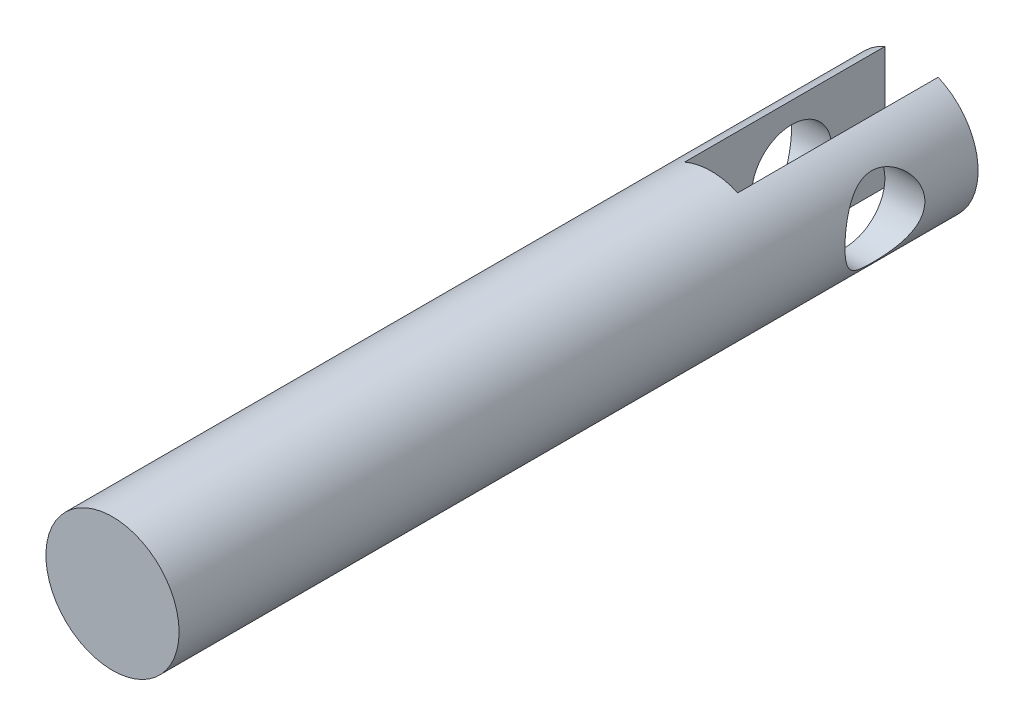
ISO-10303-21;
HEADER;
FILE_DESCRIPTION(('STEP AP214'),'2;1');
FILE_NAME('part.step','',(''),(''),'','','');
FILE_SCHEMA(('AUTOMOTIVE_DESIGN { 1 0 10303 214 1 1 1 1 }'));
ENDSEC;
DATA;
#1=APPLICATION_CONTEXT('core data for automotive mechanical design processes');
#2=APPLICATION_PROTOCOL_DEFINITION('international standard','automotive_design',2000,#1);
#3=PRODUCT_CONTEXT('',#1,'mechanical');
#4=PRODUCT('Part','Part','',(#3));
#5=PRODUCT_RELATED_PRODUCT_CATEGORY('part','',(#4));
#6=PRODUCT_DEFINITION_FORMATION('','',#4);
#7=PRODUCT_DEFINITION_CONTEXT('part definition',#1,'design');
#8=PRODUCT_DEFINITION('design','',#6,#7);
#9=PRODUCT_DEFINITION_SHAPE('','',#8);
#10=(LENGTH_UNIT() NAMED_UNIT(*) SI_UNIT(.MILLI.,.METRE.));
#11=(NAMED_UNIT(*) PLANE_ANGLE_UNIT() SI_UNIT($,.RADIAN.));
#12=(NAMED_UNIT(*) SI_UNIT($,.STERADIAN.) SOLID_ANGLE_UNIT());
#13=UNCERTAINTY_MEASURE_WITH_UNIT(LENGTH_MEASURE(1.E-05),#10,'distance_accuracy_value','');
#14=(GEOMETRIC_REPRESENTATION_CONTEXT(3) GLOBAL_UNCERTAINTY_ASSIGNED_CONTEXT((#13)) GLOBAL_UNIT_ASSIGNED_CONTEXT((#10,
#11,#12)) REPRESENTATION_CONTEXT('',''));
#15=CARTESIAN_POINT('',(0.,0.,0.));
#16=DIRECTION('',(0.,0.,1.));
#17=DIRECTION('',(1.,0.,0.));
#18=AXIS2_PLACEMENT_3D('',#15,#16,#17);
#19=CARTESIAN_POINT('',(0.,0.,0.));
#20=DIRECTION('',(0.,0.,1.));
#21=DIRECTION('',(1.,0.,0.));
#22=AXIS2_PLACEMENT_3D('',#19,#20,#21);
#23=PLANE('',#22);
#24=DIRECTION('',(0.,1.,0.));
#25=VECTOR('',#24,1.);
#26=CARTESIAN_POINT('',(-4.,0.,0.));
#27=LINE('',#26,#25);
#28=CARTESIAN_POINT('',(-4.,-9.16515138991168,0.));
#29=VERTEX_POINT('',#28);
#30=CARTESIAN_POINT('',(-4.,9.16515138991168,0.));
#31=VERTEX_POINT('',#30);
#32=EDGE_CURVE('E84',#29,#31,#27,.T.);
#33=ORIENTED_EDGE('',*,*,#32,.F.);
#34=CARTESIAN_POINT('',(0.,0.,0.));
#35=DIRECTION('',(0.,0.,1.));
#36=DIRECTION('',(1.,0.,0.));
#37=AXIS2_PLACEMENT_3D('',#34,#35,#36);
#38=CIRCLE('',#37,10.);
#39=EDGE_CURVE('E100',#31,#29,#38,.T.);
#40=ORIENTED_EDGE('',*,*,#39,.F.);
#41=EDGE_LOOP('',(#33,#40));
#42=FACE_BOUND('',#41,.T.);
#43=ADVANCED_FACE('F39',(#42),#23,.F.);
#44=CARTESIAN_POINT('',(40.,0.,14.));
#45=DIRECTION('',(-1.,0.,0.));
#46=DIRECTION('',(0.,0.,1.));
#47=AXIS2_PLACEMENT_3D('',#44,#45,#46);
#48=CYLINDRICAL_SURFACE('',#47,6.);
#49=CARTESIAN_POINT('',(-10.,0.,20.));
#50=CARTESIAN_POINT('',(-9.99999883168644,0.153537444551437,19.9999987451914));
#51=CARTESIAN_POINT('',(-9.99645496091162,0.307113729394929,19.9940973573995));
#52=CARTESIAN_POINT('',(-9.98236364463673,0.613107521326879,19.9705669868412));
#53=CARTESIAN_POINT('',(-9.97181210130936,0.765524297600021,19.9529311421879));
#54=CARTESIAN_POINT('',(-9.94394249918953,1.06824745150987,19.9061278956508));
#55=CARTESIAN_POINT('',(-9.926611630499,1.21854927251923,19.8769386617741));
#56=CARTESIAN_POINT('',(-9.88560105277181,1.51572002727398,19.8074000617416));
#57=CARTESIAN_POINT('',(-9.86191863289495,1.66258746605991,19.7670459301777));
#58=CARTESIAN_POINT('',(-9.80890481966906,1.95109561530948,19.675912399103));
#59=CARTESIAN_POINT('',(-9.77960483164848,2.09276039690219,19.62519085957));
#60=CARTESIAN_POINT('',(-9.7159192851634,2.37093083799643,19.5137256308886));
#61=CARTESIAN_POINT('',(-9.68153176235135,2.50743447905545,19.4529780695422));
#62=CARTESIAN_POINT('',(-9.57184162303337,2.90796291658618,19.2566159214806));
#63=CARTESIAN_POINT('',(-9.48994167822569,3.16336977600851,19.1067651406661));
#64=CARTESIAN_POINT('',(-9.30821070093225,3.66523770071096,18.7608918569187));
#65=CARTESIAN_POINT('',(-9.20748739861886,3.90952112480154,18.5622148675131));
#66=CARTESIAN_POINT('',(-9.00120183744764,4.36354579042123,18.130101497822));
#67=CARTESIAN_POINT('',(-8.8956334984452,4.57324202374219,17.8966205673734));
#68=CARTESIAN_POINT('',(-8.73441166956493,4.87082578782843,17.5080010021792));
#69=CARTESIAN_POINT('',(-8.67715724472595,4.97182330842636,17.3633673817549));
#70=CARTESIAN_POINT('',(-8.56585317782531,5.16122122731059,17.0648056426236));
#71=CARTESIAN_POINT('',(-8.51180406592499,5.24961954505303,16.9108759947974));
#72=CARTESIAN_POINT('',(-8.40890843735161,5.41290775237596,16.5946223175867));
#73=CARTESIAN_POINT('',(-8.36005516160798,5.48781528185459,16.4323096123317));
#74=CARTESIAN_POINT('',(-8.26947589323734,5.62338163354011,16.0999418291805));
#75=CARTESIAN_POINT('',(-8.2277472424206,5.68404577312336,15.9298896689915));
#76=CARTESIAN_POINT('',(-8.16237611554734,5.77737221892759,15.625079920862));
#77=CARTESIAN_POINT('',(-8.13679954295732,5.8132588951073,15.4917166511341));
#78=CARTESIAN_POINT('',(-8.09168021123357,5.87590039350671,15.2218704821811));
#79=CARTESIAN_POINT('',(-8.07213611544971,5.90265723881366,15.085388281244));
#80=CARTESIAN_POINT('',(-8.03976789878061,5.94666970539668,14.8102517140213));
#81=CARTESIAN_POINT('',(-8.02693687297642,5.9639350903157,14.6715997313582));
#82=CARTESIAN_POINT('',(-8.00843825390026,5.9887526638035,14.392944984699));
#83=CARTESIAN_POINT('',(-8.00277078393386,5.99630468517717,14.2529421974935));
#84=CARTESIAN_POINT('',(-7.99881555301096,6.00157990771218,13.972369514264));
#85=CARTESIAN_POINT('',(-8.00054234240933,5.99928372966397,13.8317990443929));
#86=CARTESIAN_POINT('',(-8.01134007353734,5.98485668610316,13.551452631554));
#87=CARTESIAN_POINT('',(-8.02041105095058,5.97272577280601,13.41167669245));
#88=CARTESIAN_POINT('',(-8.04555965197211,5.93880584038254,13.1338768055912));
#89=CARTESIAN_POINT('',(-8.06164043478003,5.91701246647433,12.9958536766962));
#90=CARTESIAN_POINT('',(-8.10022471868289,5.86407894147696,12.722505408924));
#91=CARTESIAN_POINT('',(-8.12273084444056,5.83293497053063,12.5871813968156));
#92=CARTESIAN_POINT('',(-8.19812127089691,5.72698063801509,12.1900392184444));
#93=CARTESIAN_POINT('',(-8.25926888138427,5.63915194131273,11.9331293629128));
#94=CARTESIAN_POINT('',(-8.39708163578852,5.43180047493027,11.4371824433193));
#95=CARTESIAN_POINT('',(-8.47375246584326,5.31226608650175,11.1981519725201));
#96=CARTESIAN_POINT('',(-8.6502223473554,5.02070076963738,10.7000519733957));
#97=CARTESIAN_POINT('',(-8.75172142070218,4.84314550121071,10.4447851195337));
#98=CARTESIAN_POINT('',(-8.90582410728345,4.54957124280611,10.0852308239826));
#99=CARTESIAN_POINT('',(-8.95754136048026,4.4470831857426,9.96918977686833));
#100=CARTESIAN_POINT('',(-9.06053415675083,4.23329437801548,9.74521758618911));
#101=CARTESIAN_POINT('',(-9.11180961955593,4.12199206183185,9.63728788996378));
#102=CARTESIAN_POINT('',(-9.21989326570382,3.87481857478411,9.41556219661114));
#103=CARTESIAN_POINT('',(-9.27647282365172,3.7376879526544,9.30305539015919));
#104=CARTESIAN_POINT('',(-9.38610941141659,3.45314122942452,9.09007333540911));
#105=CARTESIAN_POINT('',(-9.43916780480959,3.30572915572594,8.98959341742388));
#106=CARTESIAN_POINT('',(-9.54033102133582,3.00130059968158,8.80151948996676));
#107=CARTESIAN_POINT('',(-9.58843643110623,2.84428525827772,8.71392395392561));
#108=CARTESIAN_POINT('',(-9.67831544597727,2.5215578357828,8.55258975816198));
#109=CARTESIAN_POINT('',(-9.72008983683587,2.35584683737313,8.47884937856989));
#110=CARTESIAN_POINT('',(-9.79364255267099,2.02757278212963,8.35039577952599));
#111=CARTESIAN_POINT('',(-9.82588466787389,1.86546851518057,8.29477685239402));
#112=CARTESIAN_POINT('',(-9.88276955471718,1.53584722067875,8.19735404574761));
#113=CARTESIAN_POINT('',(-9.90741254446339,1.36833034862803,8.15554976973036));
#114=CARTESIAN_POINT('',(-9.94832818480364,1.02949369065073,8.08645550721117));
#115=CARTESIAN_POINT('',(-9.9646091775131,0.858177873374285,8.05915105443386));
#116=CARTESIAN_POINT('',(-9.98831668765791,0.513226306032271,8.01947106462984));
#117=CARTESIAN_POINT('',(-9.99574445045558,0.339590885735226,8.00709342788134));
#118=CARTESIAN_POINT('',(-10.0011181661532,0.0154285942464058,7.99813617993191));
#119=CARTESIAN_POINT('',(-10.0002160020556,-0.135030316693098,7.99963740594259));
#120=CARTESIAN_POINT('',(-9.99165275901541,-0.435218261170661,8.0139195620411));
#121=CARTESIAN_POINT('',(-9.98399190272153,-0.584947318588592,8.02670012055873));
#122=CARTESIAN_POINT('',(-9.96209775285793,-0.88253605659131,8.06336736303245));
#123=CARTESIAN_POINT('',(-9.94786490811761,-1.03039586412687,8.08725328855594));
#124=CARTESIAN_POINT('',(-9.91316547299699,-1.32321247217727,8.14582154811141));
#125=CARTESIAN_POINT('',(-9.89269872783916,-1.46816920051816,8.18050415020765));
#126=CARTESIAN_POINT('',(-9.84657104453397,-1.75071908629024,8.25927216096702));
#127=CARTESIAN_POINT('',(-9.82105034214295,-1.88840566825773,8.3031051413717));
#128=CARTESIAN_POINT('',(-9.76505054291717,-2.15939029274508,8.40019853297496));
#129=CARTESIAN_POINT('',(-9.73456984870001,-2.29268690477591,8.45346198177647));
#130=CARTESIAN_POINT('',(-9.6365771020272,-2.68492536011212,8.62666324398916));
#131=CARTESIAN_POINT('',(-9.56247925125989,-2.9364228638402,8.76007047965107));
#132=CARTESIAN_POINT('',(-9.39381699318939,-3.440061294319,9.07423511966946));
#133=CARTESIAN_POINT('',(-9.29792673244944,-3.68956141515482,9.25846926282631));
#134=CARTESIAN_POINT('',(-9.0989559830121,-4.15611932969621,9.66159165794956));
#135=CARTESIAN_POINT('',(-8.99586720626164,-4.37313879233221,9.88052023619072));
#136=CARTESIAN_POINT('',(-8.83567180051123,-4.68476192706763,10.24723481991));
#137=CARTESIAN_POINT('',(-8.77804452474304,-4.79158950335553,10.3846104160551));
#138=CARTESIAN_POINT('',(-8.66487441639236,-4.99332637800024,10.6687773745287));
#139=CARTESIAN_POINT('',(-8.6093321252939,-5.08823259511329,10.8155711563696));
#140=CARTESIAN_POINT('',(-8.50216742436207,-5.26534568264164,11.1178468693937));
#141=CARTESIAN_POINT('',(-8.45054240595251,-5.34756104251849,11.2733228970109));
#142=CARTESIAN_POINT('',(-8.35308038859148,-5.49855628026276,11.5923086841269));
#143=CARTESIAN_POINT('',(-8.30723930239863,-5.56734566466805,11.7558126558527));
#144=CARTESIAN_POINT('',(-8.23231224945508,-5.67736385859908,12.0539630023382));
#145=CARTESIAN_POINT('',(-8.20174483337219,-5.72133709184489,12.1872293860132));
#146=CARTESIAN_POINT('',(-8.14626667510692,-5.80005690886224,12.4575537367309));
#147=CARTESIAN_POINT('',(-8.12135296146618,-5.83480834103845,12.5946096693798));
#148=CARTESIAN_POINT('',(-8.07801879862436,-5.8946568885387,12.8716884042916));
#149=CARTESIAN_POINT('',(-8.05959195410913,-5.91976351478429,13.0117081393465));
#150=CARTESIAN_POINT('',(-8.02987210085861,-5.9600153732825,13.2939325213585));
#151=CARTESIAN_POINT('',(-8.01857913377509,-5.97516054737435,13.4361371810677));
#152=CARTESIAN_POINT('',(-8.0035422228399,-5.99528753337017,13.7222138241734));
#153=CARTESIAN_POINT('',(-7.999827227501,-6.00023037231476,13.8660900975585));
#154=CARTESIAN_POINT('',(-8.00018515536029,-5.99975311757475,14.1538157402708));
#155=CARTESIAN_POINT('',(-8.00425809224595,-5.99433300567701,14.2976651095502));
#156=CARTESIAN_POINT('',(-8.02002886262284,-5.97321593242882,14.5842489566588));
#157=CARTESIAN_POINT('',(-8.03173032236349,-5.9575140835971,14.726982871581));
#158=CARTESIAN_POINT('',(-8.06229956209071,-5.91607855231599,15.0101981542411));
#159=CARTESIAN_POINT('',(-8.08116737166849,-5.89034482844308,15.1506795126752));
#160=CARTESIAN_POINT('',(-8.12430163249588,-5.83069515235668,15.4217258574097));
#161=CARTESIAN_POINT('',(-8.14826151524265,-5.79723709119028,15.5524411592059));
#162=CARTESIAN_POINT('',(-8.2013135481482,-5.72193802024644,15.810385741413));
#163=CARTESIAN_POINT('',(-8.23040742870393,-5.68009418342386,15.9376138297136));
#164=CARTESIAN_POINT('',(-8.32420030637917,-5.5425635782989,16.3132274615395));
#165=CARTESIAN_POINT('',(-8.39543383966226,-5.43484692597259,16.5556799534707));
#166=CARTESIAN_POINT('',(-8.5605234540185,-5.17156568978209,17.0573127364038));
#167=CARTESIAN_POINT('',(-8.6561736985039,-5.01119401055785,17.3133461256292));
#168=CARTESIAN_POINT('',(-8.85281489413667,-4.65500060946757,17.7975385953748));
#169=CARTESIAN_POINT('',(-8.95381019436587,-4.45914969547372,18.0256744610982));
#170=CARTESIAN_POINT('',(-9.11118672816113,-4.12370341470836,18.36183660388));
#171=CARTESIAN_POINT('',(-9.16858001952611,-3.9947869496437,18.4802250426702));
#172=CARTESIAN_POINT('',(-9.28086988407214,-3.72646931290711,18.7057534975023));
#173=CARTESIAN_POINT('',(-9.3357672170491,-3.58707136666571,18.8128969498073));
#174=CARTESIAN_POINT('',(-9.44166188164684,-3.29828675494298,19.0152180045666));
#175=CARTESIAN_POINT('',(-9.49265642349905,-3.14889308474009,19.1103870782948));
#176=CARTESIAN_POINT('',(-9.58931425936429,-2.84096458145434,19.2877668512041));
#177=CARTESIAN_POINT('',(-9.63497822073852,-2.68243089637472,19.3699791729558));
#178=CARTESIAN_POINT('',(-9.71838319081371,-2.36211349400593,19.5182071558255));
#179=CARTESIAN_POINT('',(-9.75632252421502,-2.20057425723904,19.5846384952261));
#180=CARTESIAN_POINT('',(-9.82486154361095,-1.87094026552716,19.703530953194));
#181=CARTESIAN_POINT('',(-9.85546263753239,-1.70284677529884,19.7559947518102));
#182=CARTESIAN_POINT('',(-9.90830915235697,-1.36200638705992,19.8460169433512));
#183=CARTESIAN_POINT('',(-9.93058053649488,-1.18927577776317,19.8836216722147));
#184=CARTESIAN_POINT('',(-9.96616672075865,-0.840366716144956,19.9434891926353));
#185=CARTESIAN_POINT('',(-9.97948898025471,-0.664191261592118,19.9657647618972));
#186=CARTESIAN_POINT('',(-9.99207457493582,-0.406248020354692,19.986783372373));
#187=CARTESIAN_POINT('',(-9.99504405536016,-0.325112869232343,19.9917369756772));
#188=CARTESIAN_POINT('',(-9.99900711160739,-0.162655449357515,19.9983456790547));
#189=CARTESIAN_POINT('',(-10.0000006188891,-0.0813331742121625,20.000000664708));
#190=CARTESIAN_POINT('',(-10.,0.,20.));
#191=B_SPLINE_CURVE_WITH_KNOTS('',3,(#49,#50,#51,#52,#53,#54,#55,#56,#57,#58,#59,#60,#61,#62,
#63,#64,#65,#66,#67,#68,#69,#70,#71,#72,#73,#74,#75,#76,#77,#78,#79,#80,#81,#82,#83,#84,#85,#86,
#87,#88,#89,#90,#91,#92,#93,#94,#95,#96,#97,#98,#99,#100,#101,#102,#103,#104,#105,#106,#107,
#108,#109,#110,#111,#112,#113,#114,#115,#116,#117,#118,#119,#120,#121,#122,#123,#124,#125,#126,
#127,#128,#129,#130,#131,#132,#133,#134,#135,#136,#137,#138,#139,#140,#141,#142,#143,#144,#145,
#146,#147,#148,#149,#150,#151,#152,#153,#154,#155,#156,#157,#158,#159,#160,#161,#162,#163,#164,
#165,#166,#167,#168,#169,#170,#171,#172,#173,#174,#175,#176,#177,#178,#179,#180,#181,#182,#183,
#184,#185,#186,#187,#188,#189,#190),.UNSPECIFIED.,.T.,.F.,(4,2,2,2,2,2,2,2,2,2,2,2,2,2,2,2,2,2,
2,2,2,2,2,2,2,2,2,2,2,2,2,2,2,2,2,2,2,2,2,2,2,2,2,2,2,2,2,2,2,2,2,2,2,2,2,2,2,2,2,2,2,2,2,2,2,2,
2,2,2,2,4),(0.,0.460526601189238,0.921322738666801,1.38299381403058,1.84486224490669,
2.30422013956031,2.76375586197537,3.68167311554442,4.66978395284545,5.65917064091953,
6.21499415637784,6.77090935054836,7.32609229452149,7.8810676455441,8.30201487574485,
8.72286876721019,9.1432889221606,9.56371631366182,9.98497139806241,10.4062285292501,
10.8276757104407,11.2492952938387,12.0807558666506,12.9125215553463,13.8897049719634,
14.3790534646455,14.8684890673691,15.4263461011955,15.983985828052,16.5415594312421,
17.0990637758594,17.6214641151699,18.1438494594443,18.6657126431692,19.1875024090024,
19.638346895262,20.0891765301004,20.5399753803935,20.9907854241961,21.4305002375878,
21.8703569439357,22.7494233427058,23.7197001490793,24.6911131196182,25.2405264723239,
25.7900815377537,26.3392673739261,26.8880629256888,27.3185187217206,27.7487477532128,
28.1785514321197,28.6083576204495,29.0398026540948,29.4712484460159,29.9028994771413,
30.3345522906548,30.7452488920627,31.156084182716,31.9773303104337,32.9246646516038,
33.8727820243207,34.4248169890476,34.9766827677429,35.5289394130232,36.0811268442983,
36.6165634055116,37.1518971546363,37.685548110701,38.2187536985203,38.4626993445494,
38.706653452248),.UNSPECIFIED.);
#192=CARTESIAN_POINT('',(-10.,0.,20.));
#193=VERTEX_POINT('',#192);
#194=EDGE_CURVE('E110',#193,#193,#191,.T.);
#195=ORIENTED_EDGE('',*,*,#194,.T.);
#196=EDGE_LOOP('',(#195));
#197=FACE_BOUND('',#196,.T.);
#198=CARTESIAN_POINT('',(-4.,0.,14.));
#199=DIRECTION('',(1.,0.,0.));
#200=DIRECTION('',(0.,0.,-1.));
#201=AXIS2_PLACEMENT_3D('',#198,#199,#200);
#202=CIRCLE('',#201,6.);
#203=CARTESIAN_POINT('',(-4.,0.,8.));
#204=VERTEX_POINT('',#203);
#205=EDGE_CURVE('E146',#204,#204,#202,.T.);
#206=ORIENTED_EDGE('',*,*,#205,.T.);
#207=EDGE_LOOP('',(#206));
#208=FACE_BOUND('',#207,.T.);
#209=ADVANCED_FACE('F129',(#197,#208),#48,.F.);
#210=CARTESIAN_POINT('',(0.,0.,120.));
#211=DIRECTION('',(0.,0.,-1.));
#212=DIRECTION('',(-1.,0.,0.));
#213=AXIS2_PLACEMENT_3D('',#210,#211,#212);
#214=CYLINDRICAL_SURFACE('',#213,10.);
#215=CARTESIAN_POINT('',(0.,0.,120.));
#216=DIRECTION('',(0.,0.,1.));
#217=DIRECTION('',(1.,0.,0.));
#218=AXIS2_PLACEMENT_3D('',#215,#216,#217);
#219=CIRCLE('',#218,10.);
#220=CARTESIAN_POINT('',(10.,0.,120.));
#221=VERTEX_POINT('',#220);
#222=EDGE_CURVE('E98',#221,#221,#219,.T.);
#223=ORIENTED_EDGE('',*,*,#222,.F.);
#224=EDGE_LOOP('',(#223));
#225=FACE_BOUND('',#224,.T.);
#226=CARTESIAN_POINT('',(0.,0.,30.0862718765532));
#227=DIRECTION('',(0.,0.,-1.));
#228=DIRECTION('',(-1.,0.,0.));
#229=AXIS2_PLACEMENT_3D('',#226,#227,#228);
#230=CIRCLE('',#229,10.);
#231=CARTESIAN_POINT('',(4.,-9.16515138991168,30.0862718765532));
#232=VERTEX_POINT('',#231);
#233=CARTESIAN_POINT('',(-4.,-9.16515138991168,30.0862718765532));
#234=VERTEX_POINT('',#233);
#235=EDGE_CURVE('E11',#232,#234,#230,.T.);
#236=ORIENTED_EDGE('',*,*,#235,.F.);
#237=DIRECTION('',(0.,0.,-1.));
#238=VECTOR('',#237,1.);
#239=CARTESIAN_POINT('',(4.,-9.16515138991168,120.));
#240=LINE('',#239,#238);
#241=CARTESIAN_POINT('',(4.,-9.16515138991168,0.));
#242=VERTEX_POINT('',#241);
#243=EDGE_CURVE('E107',#232,#242,#240,.T.);
#244=ORIENTED_EDGE('',*,*,#243,.T.);
#245=CARTESIAN_POINT('',(4.,9.16515138991168,0.));
#246=VERTEX_POINT('',#245);
#247=EDGE_CURVE('E104',#242,#246,#38,.T.);
#248=ORIENTED_EDGE('',*,*,#247,.T.);
#249=DIRECTION('',(0.,0.,-1.));
#250=VECTOR('',#249,1.);
#251=CARTESIAN_POINT('',(4.,9.16515138991168,120.));
#252=LINE('',#251,#250);
#253=CARTESIAN_POINT('',(4.,9.16515138991168,30.0862718765532));
#254=VERTEX_POINT('',#253);
#255=EDGE_CURVE('E63',#246,#254,#252,.F.);
#256=ORIENTED_EDGE('',*,*,#255,.T.);
#257=CARTESIAN_POINT('',(-4.,9.16515138991168,30.0862718765532));
#258=VERTEX_POINT('',#257);
#259=EDGE_CURVE('E44',#258,#254,#230,.T.);
#260=ORIENTED_EDGE('',*,*,#259,.F.);
#261=DIRECTION('',(0.,0.,-1.));
#262=VECTOR('',#261,1.);
#263=CARTESIAN_POINT('',(-4.,9.16515138991168,120.));
#264=LINE('',#263,#262);
#265=EDGE_CURVE('E80',#31,#258,#264,.F.);
#266=ORIENTED_EDGE('',*,*,#265,.F.);
#267=ORIENTED_EDGE('',*,*,#39,.T.);
#268=DIRECTION('',(0.,0.,-1.));
#269=VECTOR('',#268,1.);
#270=CARTESIAN_POINT('',(-4.,-9.16515138991168,120.));
#271=LINE('',#270,#269);
#272=EDGE_CURVE('E55',#234,#29,#271,.T.);
#273=ORIENTED_EDGE('',*,*,#272,.F.);
#274=EDGE_LOOP('',(#236,#244,#248,#256,#260,#266,#267,#273));
#275=FACE_BOUND('',#274,.T.);
#276=CARTESIAN_POINT('',(10.,0.,20.));
#277=CARTESIAN_POINT('',(9.99999883168644,-0.153537444551437,19.9999987451914));
#278=CARTESIAN_POINT('',(9.99645496091162,-0.307113729394928,19.9940973573995));
#279=CARTESIAN_POINT('',(9.98236364463673,-0.613107521326879,19.9705669868412));
#280=CARTESIAN_POINT('',(9.97181210130936,-0.765524297600021,19.9529311421879));
#281=CARTESIAN_POINT('',(9.94394249918953,-1.06824745150987,19.9061278956508));
#282=CARTESIAN_POINT('',(9.926611630499,-1.21854927251923,19.8769386617741));
#283=CARTESIAN_POINT('',(9.88560105277181,-1.51572002727398,19.8074000617416));
#284=CARTESIAN_POINT('',(9.86191863289495,-1.66258746605991,19.7670459301777));
#285=CARTESIAN_POINT('',(9.80890481966906,-1.95109561530948,19.675912399103));
#286=CARTESIAN_POINT('',(9.77960483164848,-2.09276039690219,19.62519085957));
#287=CARTESIAN_POINT('',(9.7159192851634,-2.37093083799643,19.5137256308886));
#288=CARTESIAN_POINT('',(9.68153176235135,-2.50743447905545,19.4529780695422));
#289=CARTESIAN_POINT('',(9.57184162303337,-2.90796291658618,19.2566159214806));
#290=CARTESIAN_POINT('',(9.48994167822569,-3.16336977600851,19.1067651406661));
#291=CARTESIAN_POINT('',(9.30821070093225,-3.66523770071096,18.7608918569187));
#292=CARTESIAN_POINT('',(9.20748739861886,-3.90952112480153,18.5622148675131));
#293=CARTESIAN_POINT('',(9.00120183744764,-4.36354579042122,18.130101497822));
#294=CARTESIAN_POINT('',(8.8956334984452,-4.57324202374219,17.8966205673734));
#295=CARTESIAN_POINT('',(8.73441166956493,-4.87082578782842,17.5080010021792));
#296=CARTESIAN_POINT('',(8.67715724472595,-4.97182330842636,17.3633673817549));
#297=CARTESIAN_POINT('',(8.56585317782531,-5.16122122731059,17.0648056426236));
#298=CARTESIAN_POINT('',(8.51180406592499,-5.24961954505303,16.9108759947974));
#299=CARTESIAN_POINT('',(8.40890843735161,-5.41290775237596,16.5946223175868));
#300=CARTESIAN_POINT('',(8.36005516160798,-5.48781528185459,16.4323096123317));
#301=CARTESIAN_POINT('',(8.26947589323735,-5.62338163354011,16.0999418291806));
#302=CARTESIAN_POINT('',(8.22774724242061,-5.68404577312335,15.9298896689915));
#303=CARTESIAN_POINT('',(8.16237611554734,-5.77737221892759,15.625079920862));
#304=CARTESIAN_POINT('',(8.13679954295732,-5.8132588951073,15.4917166511341));
#305=CARTESIAN_POINT('',(8.09168021123357,-5.87590039350671,15.2218704821811));
#306=CARTESIAN_POINT('',(8.07213611544971,-5.90265723881365,15.0853882812441));
#307=CARTESIAN_POINT('',(8.03976789878061,-5.94666970539668,14.8102517140214));
#308=CARTESIAN_POINT('',(8.02693687297642,-5.9639350903157,14.6715997313582));
#309=CARTESIAN_POINT('',(8.00843825390026,-5.9887526638035,14.392944984699));
#310=CARTESIAN_POINT('',(8.00277078393386,-5.99630468517717,14.2529421974935));
#311=CARTESIAN_POINT('',(7.99881555301096,-6.00157990771218,13.972369514264));
#312=CARTESIAN_POINT('',(8.00054234240933,-5.99928372966397,13.8317990443929));
#313=CARTESIAN_POINT('',(8.01134007353734,-5.98485668610316,13.551452631554));
#314=CARTESIAN_POINT('',(8.02041105095058,-5.97272577280601,13.41167669245));
#315=CARTESIAN_POINT('',(8.04555965197211,-5.93880584038254,13.1338768055912));
#316=CARTESIAN_POINT('',(8.06164043478003,-5.91701246647433,12.9958536766962));
#317=CARTESIAN_POINT('',(8.10022471868289,-5.86407894147697,12.722505408924));
#318=CARTESIAN_POINT('',(8.12273084444056,-5.83293497053063,12.5871813968156));
#319=CARTESIAN_POINT('',(8.19812127089691,-5.7269806380151,12.1900392184444));
#320=CARTESIAN_POINT('',(8.25926888138427,-5.63915194131273,11.9331293629128));
#321=CARTESIAN_POINT('',(8.39708163578852,-5.43180047493027,11.4371824433193));
#322=CARTESIAN_POINT('',(8.47375246584326,-5.31226608650176,11.1981519725201));
#323=CARTESIAN_POINT('',(8.65022234735539,-5.02070076963738,10.7000519733957));
#324=CARTESIAN_POINT('',(8.75172142070218,-4.84314550121072,10.4447851195337));
#325=CARTESIAN_POINT('',(8.90582410728344,-4.54957124280612,10.0852308239826));
#326=CARTESIAN_POINT('',(8.95754136048026,-4.44708318574261,9.96918977686834));
#327=CARTESIAN_POINT('',(9.06053415675083,-4.23329437801549,9.74521758618912));
#328=CARTESIAN_POINT('',(9.11180961955592,-4.12199206183186,9.63728788996379));
#329=CARTESIAN_POINT('',(9.21989326570382,-3.87481857478412,9.41556219661115));
#330=CARTESIAN_POINT('',(9.27647282365172,-3.7376879526544,9.3030553901592));
#331=CARTESIAN_POINT('',(9.38610941141659,-3.45314122942452,9.09007333540912));
#332=CARTESIAN_POINT('',(9.43916780480959,-3.30572915572595,8.98959341742388));
#333=CARTESIAN_POINT('',(9.54033102133581,-3.00130059968159,8.80151948996677));
#334=CARTESIAN_POINT('',(9.58843643110623,-2.84428525827773,8.71392395392561));
#335=CARTESIAN_POINT('',(9.67831544597727,-2.52155783578281,8.55258975816198));
#336=CARTESIAN_POINT('',(9.72008983683587,-2.35584683737314,8.47884937856989));
#337=CARTESIAN_POINT('',(9.79364255267099,-2.02757278212964,8.35039577952599));
#338=CARTESIAN_POINT('',(9.82588466787389,-1.86546851518057,8.29477685239402));
#339=CARTESIAN_POINT('',(9.88276955471718,-1.53584722067875,8.19735404574761));
#340=CARTESIAN_POINT('',(9.90741254446339,-1.36833034862803,8.15554976973036));
#341=CARTESIAN_POINT('',(9.94832818480364,-1.02949369065074,8.08645550721117));
#342=CARTESIAN_POINT('',(9.96460917751309,-0.858177873374292,8.05915105443386));
#343=CARTESIAN_POINT('',(9.9883166876579,-0.513226306032278,8.01947106462984));
#344=CARTESIAN_POINT('',(9.99574445045558,-0.339590885735232,8.00709342788134));
#345=CARTESIAN_POINT('',(10.0011181661532,-0.0154285942464127,7.99813617993191));
#346=CARTESIAN_POINT('',(10.0002160020556,0.135030316693091,7.99963740594259));
#347=CARTESIAN_POINT('',(9.99165275901541,0.435218261170655,8.0139195620411));
#348=CARTESIAN_POINT('',(9.98399190272153,0.584947318588587,8.02670012055873));
#349=CARTESIAN_POINT('',(9.96209775285793,0.882536056591305,8.06336736303245));
#350=CARTESIAN_POINT('',(9.94786490811761,1.03039586412687,8.08725328855594));
#351=CARTESIAN_POINT('',(9.913165472997,1.32321247217727,8.1458215481114));
#352=CARTESIAN_POINT('',(9.89269872783916,1.46816920051816,8.18050415020765));
#353=CARTESIAN_POINT('',(9.84657104453397,1.75071908629023,8.25927216096702));
#354=CARTESIAN_POINT('',(9.82105034214295,1.88840566825773,8.3031051413717));
#355=CARTESIAN_POINT('',(9.76505054291717,2.15939029274507,8.40019853297496));
#356=CARTESIAN_POINT('',(9.73456984870001,2.2926869047759,8.45346198177647));
#357=CARTESIAN_POINT('',(9.6365771020272,2.68492536011212,8.62666324398916));
#358=CARTESIAN_POINT('',(9.56247925125989,2.9364228638402,8.76007047965107));
#359=CARTESIAN_POINT('',(9.39381699318939,3.44006129431899,9.07423511966945));
#360=CARTESIAN_POINT('',(9.29792673244944,3.68956141515481,9.25846926282631));
#361=CARTESIAN_POINT('',(9.09895598301211,4.1561193296962,9.66159165794955));
#362=CARTESIAN_POINT('',(8.99586720626164,4.3731387923322,9.88052023619071));
#363=CARTESIAN_POINT('',(8.83567180051124,4.68476192706763,10.24723481991));
#364=CARTESIAN_POINT('',(8.77804452474304,4.79158950335553,10.3846104160551));
#365=CARTESIAN_POINT('',(8.66487441639236,4.99332637800023,10.6687773745287));
#366=CARTESIAN_POINT('',(8.6093321252939,5.08823259511328,10.8155711563696));
#367=CARTESIAN_POINT('',(8.50216742436207,5.26534568264163,11.1178468693937));
#368=CARTESIAN_POINT('',(8.45054240595252,5.34756104251849,11.2733228970108));
#369=CARTESIAN_POINT('',(8.35308038859149,5.49855628026275,11.5923086841269));
#370=CARTESIAN_POINT('',(8.30723930239864,5.56734566466805,11.7558126558527));
#371=CARTESIAN_POINT('',(8.23231224945508,5.67736385859907,12.0539630023382));
#372=CARTESIAN_POINT('',(8.20174483337219,5.72133709184488,12.1872293860132));
#373=CARTESIAN_POINT('',(8.14626667510692,5.80005690886224,12.4575537367309));
#374=CARTESIAN_POINT('',(8.12135296146618,5.83480834103845,12.5946096693797));
#375=CARTESIAN_POINT('',(8.07801879862436,5.8946568885387,12.8716884042916));
#376=CARTESIAN_POINT('',(8.05959195410913,5.91976351478428,13.0117081393465));
#377=CARTESIAN_POINT('',(8.02987210085861,5.9600153732825,13.2939325213585));
#378=CARTESIAN_POINT('',(8.01857913377509,5.97516054737435,13.4361371810676));
#379=CARTESIAN_POINT('',(8.0035422228399,5.99528753337017,13.7222138241734));
#380=CARTESIAN_POINT('',(7.999827227501,6.00023037231476,13.8660900975585));
#381=CARTESIAN_POINT('',(8.00018515536029,5.99975311757475,14.1538157402708));
#382=CARTESIAN_POINT('',(8.00425809224595,5.99433300567701,14.2976651095502));
#383=CARTESIAN_POINT('',(8.02002886262284,5.97321593242882,14.5842489566588));
#384=CARTESIAN_POINT('',(8.03173032236349,5.9575140835971,14.726982871581));
#385=CARTESIAN_POINT('',(8.06229956209071,5.91607855231599,15.0101981542411));
#386=CARTESIAN_POINT('',(8.08116737166849,5.89034482844308,15.1506795126752));
#387=CARTESIAN_POINT('',(8.12430163249587,5.83069515235668,15.4217258574097));
#388=CARTESIAN_POINT('',(8.14826151524265,5.79723709119028,15.5524411592059));
#389=CARTESIAN_POINT('',(8.2013135481482,5.72193802024644,15.810385741413));
#390=CARTESIAN_POINT('',(8.23040742870393,5.68009418342386,15.9376138297136));
#391=CARTESIAN_POINT('',(8.32420030637917,5.5425635782989,16.3132274615395));
#392=CARTESIAN_POINT('',(8.39543383966226,5.43484692597259,16.5556799534707));
#393=CARTESIAN_POINT('',(8.5605234540185,5.1715656897821,17.0573127364038));
#394=CARTESIAN_POINT('',(8.6561736985039,5.01119401055785,17.3133461256292));
#395=CARTESIAN_POINT('',(8.85281489413666,4.65500060946758,17.7975385953748));
#396=CARTESIAN_POINT('',(8.95381019436586,4.45914969547373,18.0256744610981));
#397=CARTESIAN_POINT('',(9.11118672816113,4.12370341470836,18.36183660388));
#398=CARTESIAN_POINT('',(9.16858001952611,3.9947869496437,18.4802250426702));
#399=CARTESIAN_POINT('',(9.28086988407214,3.72646931290711,18.7057534975023));
#400=CARTESIAN_POINT('',(9.3357672170491,3.58707136666572,18.8128969498073));
#401=CARTESIAN_POINT('',(9.44166188164684,3.298286754943,19.0152180045666));
#402=CARTESIAN_POINT('',(9.49265642349905,3.1488930847401,19.1103870782948));
#403=CARTESIAN_POINT('',(9.58931425936428,2.84096458145435,19.287766851204));
#404=CARTESIAN_POINT('',(9.63497822073852,2.68243089637474,19.3699791729558));
#405=CARTESIAN_POINT('',(9.71838319081371,2.36211349400594,19.5182071558255));
#406=CARTESIAN_POINT('',(9.75632252421502,2.20057425723905,19.5846384952261));
#407=CARTESIAN_POINT('',(9.82486154361095,1.87094026552717,19.703530953194));
#408=CARTESIAN_POINT('',(9.85546263753239,1.70284677529885,19.7559947518102));
#409=CARTESIAN_POINT('',(9.90830915235696,1.36200638705993,19.8460169433512));
#410=CARTESIAN_POINT('',(9.93058053649488,1.18927577776318,19.8836216722147));
#411=CARTESIAN_POINT('',(9.96616672075864,0.840366716144969,19.9434891926353));
#412=CARTESIAN_POINT('',(9.97948898025471,0.664191261592129,19.9657647618972));
#413=CARTESIAN_POINT('',(9.99207457493582,0.4062480203547,19.986783372373));
#414=CARTESIAN_POINT('',(9.99504405536016,0.32511286923235,19.9917369756772));
#415=CARTESIAN_POINT('',(9.99900711160739,0.16265544935752,19.9983456790547));
#416=CARTESIAN_POINT('',(10.0000006188891,0.0813331742121651,20.000000664708));
#417=CARTESIAN_POINT('',(10.,0.,20.));
#418=B_SPLINE_CURVE_WITH_KNOTS('',3,(#276,#277,#278,#279,#280,#281,#282,#283,#284,#285,#286,
#287,#288,#289,#290,#291,#292,#293,#294,#295,#296,#297,#298,#299,#300,#301,#302,#303,#304,#305,
#306,#307,#308,#309,#310,#311,#312,#313,#314,#315,#316,#317,#318,#319,#320,#321,#322,#323,#324,
#325,#326,#327,#328,#329,#330,#331,#332,#333,#334,#335,#336,#337,#338,#339,#340,#341,#342,#343,
#344,#345,#346,#347,#348,#349,#350,#351,#352,#353,#354,#355,#356,#357,#358,#359,#360,#361,#362,
#363,#364,#365,#366,#367,#368,#369,#370,#371,#372,#373,#374,#375,#376,#377,#378,#379,#380,#381,
#382,#383,#384,#385,#386,#387,#388,#389,#390,#391,#392,#393,#394,#395,#396,#397,#398,#399,#400,
#401,#402,#403,#404,#405,#406,#407,#408,#409,#410,#411,#412,#413,#414,#415,#416,#417),
.UNSPECIFIED.,.T.,.F.,(4,2,2,2,2,2,2,2,2,2,2,2,2,2,2,2,2,2,2,2,2,2,2,2,2,2,2,2,2,2,2,2,2,2,2,2,
2,2,2,2,2,2,2,2,2,2,2,2,2,2,2,2,2,2,2,2,2,2,2,2,2,2,2,2,2,2,2,2,2,2,4),(0.,0.460526601189237,
0.9213227386668,1.38299381403058,1.84486224490669,2.30422013956031,2.76375586197537,
3.68167311554442,4.66978395284544,5.65917064091953,6.21499415637784,6.77090935054835,
7.32609229452149,7.88106764554409,8.30201487574484,8.72286876721018,9.14328892216059,
9.56371631366181,9.9849713980624,10.40622852925,10.8276757104407,11.2492952938386,
12.0807558666506,12.9125215553463,13.8897049719634,14.3790534646455,14.8684890673691,
15.4263461011955,15.983985828052,16.5415594312421,17.0990637758594,17.6214641151699,
18.1438494594443,18.6657126431692,19.1875024090024,19.638346895262,20.0891765301004,
20.5399753803935,20.9907854241961,21.4305002375878,21.8703569439357,22.7494233427058,
23.7197001490793,24.6911131196182,25.2405264723239,25.7900815377537,26.3392673739261,
26.8880629256888,27.3185187217206,27.7487477532128,28.1785514321197,28.6083576204495,
29.0398026540948,29.4712484460159,29.9028994771412,30.3345522906548,30.7452488920627,
31.156084182716,31.9773303104337,32.9246646516038,33.8727820243206,34.4248169890476,
34.9766827677429,35.5289394130232,36.0811268442983,36.6165634055116,37.1518971546363,
37.685548110701,38.2187536985203,38.4626993445494,38.706653452248),.UNSPECIFIED.);
#419=CARTESIAN_POINT('',(10.,0.,20.));
#420=VERTEX_POINT('',#419);
#421=EDGE_CURVE('E111',#420,#420,#418,.T.);
#422=ORIENTED_EDGE('',*,*,#421,.F.);
#423=EDGE_LOOP('',(#422));
#424=FACE_BOUND('',#423,.T.);
#425=ORIENTED_EDGE('',*,*,#194,.F.);
#426=EDGE_LOOP('',(#425));
#427=FACE_BOUND('',#426,.T.);
#428=ADVANCED_FACE('F41',(#225,#275,#424,#427),#214,.T.);
#429=CARTESIAN_POINT('',(0.,0.,120.));
#430=DIRECTION('',(0.,0.,1.));
#431=DIRECTION('',(1.,0.,0.));
#432=AXIS2_PLACEMENT_3D('',#429,#430,#431);
#433=PLANE('',#432);
#434=ORIENTED_EDGE('',*,*,#222,.T.);
#435=EDGE_LOOP('',(#434));
#436=FACE_BOUND('',#435,.T.);
#437=ADVANCED_FACE('F131',(#436),#433,.T.);
#438=ORIENTED_EDGE('',*,*,#247,.F.);
#439=DIRECTION('',(0.,1.,0.));
#440=VECTOR('',#439,1.);
#441=CARTESIAN_POINT('',(4.,0.,0.));
#442=LINE('',#441,#440);
#443=EDGE_CURVE('E152',#242,#246,#442,.T.);
#444=ORIENTED_EDGE('',*,*,#443,.T.);
#445=EDGE_LOOP('',(#438,#444));
#446=FACE_BOUND('',#445,.T.);
#447=ADVANCED_FACE('F127',(#446),#23,.F.);
#448=CARTESIAN_POINT('',(4.,0.,14.));
#449=DIRECTION('',(1.,0.,0.));
#450=DIRECTION('',(0.,0.,-1.));
#451=AXIS2_PLACEMENT_3D('',#448,#449,#450);
#452=CIRCLE('',#451,6.);
#453=CARTESIAN_POINT('',(4.,0.,8.));
#454=VERTEX_POINT('',#453);
#455=EDGE_CURVE('E149',#454,#454,#452,.T.);
#456=ORIENTED_EDGE('',*,*,#455,.F.);
#457=EDGE_LOOP('',(#456));
#458=FACE_BOUND('',#457,.T.);
#459=ORIENTED_EDGE('',*,*,#421,.T.);
#460=EDGE_LOOP('',(#459));
#461=FACE_BOUND('',#460,.T.);
#462=ADVANCED_FACE('F122',(#458,#461),#48,.F.);
#463=CARTESIAN_POINT('',(4.,-11.1228510205492,30.0862718765532));
#464=DIRECTION('',(0.,0.,-1.));
#465=DIRECTION('',(-1.,0.,0.));
#466=AXIS2_PLACEMENT_3D('',#463,#464,#465);
#467=PLANE('',#466);
#468=ORIENTED_EDGE('',*,*,#259,.T.);
#469=DIRECTION('',(0.,-1.,0.));
#470=VECTOR('',#469,1.);
#471=CARTESIAN_POINT('',(4.,-11.1228510205492,30.0862718765532));
#472=LINE('',#471,#470);
#473=EDGE_CURVE('E94',#254,#232,#472,.T.);
#474=ORIENTED_EDGE('',*,*,#473,.T.);
#475=ORIENTED_EDGE('',*,*,#235,.T.);
#476=DIRECTION('',(0.,-1.,0.));
#477=VECTOR('',#476,1.);
#478=CARTESIAN_POINT('',(-4.,-11.1228510205492,30.0862718765532));
#479=LINE('',#478,#477);
#480=EDGE_CURVE('E83',#258,#234,#479,.T.);
#481=ORIENTED_EDGE('',*,*,#480,.F.);
#482=EDGE_LOOP('',(#468,#474,#475,#481));
#483=FACE_BOUND('',#482,.T.);
#484=ADVANCED_FACE('F91',(#483),#467,.T.);
#485=CARTESIAN_POINT('',(4.,0.,0.));
#486=DIRECTION('',(1.,0.,0.));
#487=DIRECTION('',(0.,0.,-1.));
#488=AXIS2_PLACEMENT_3D('',#485,#486,#487);
#489=PLANE('',#488);
#490=ORIENTED_EDGE('',*,*,#455,.T.);
#491=EDGE_LOOP('',(#490));
#492=FACE_BOUND('',#491,.T.);
#493=ORIENTED_EDGE('',*,*,#473,.F.);
#494=ORIENTED_EDGE('',*,*,#255,.F.);
#495=ORIENTED_EDGE('',*,*,#443,.F.);
#496=ORIENTED_EDGE('',*,*,#243,.F.);
#497=EDGE_LOOP('',(#493,#494,#495,#496));
#498=FACE_BOUND('',#497,.T.);
#499=ADVANCED_FACE('F154',(#492,#498),#489,.F.);
#500=CARTESIAN_POINT('',(-4.,0.,0.));
#501=DIRECTION('',(1.,0.,0.));
#502=DIRECTION('',(0.,0.,-1.));
#503=AXIS2_PLACEMENT_3D('',#500,#501,#502);
#504=PLANE('',#503);
#505=ORIENTED_EDGE('',*,*,#205,.F.);
#506=EDGE_LOOP('',(#505));
#507=FACE_BOUND('',#506,.T.);
#508=ORIENTED_EDGE('',*,*,#272,.T.);
#509=ORIENTED_EDGE('',*,*,#32,.T.);
#510=ORIENTED_EDGE('',*,*,#265,.T.);
#511=ORIENTED_EDGE('',*,*,#480,.T.);
#512=EDGE_LOOP('',(#508,#509,#510,#511));
#513=FACE_BOUND('',#512,.T.);
#514=ADVANCED_FACE('F82',(#507,#513),#504,.T.);
#515=CLOSED_SHELL('',(#43,#209,#428,#437,#447,#462,#484,#499,#514));
#516=MANIFOLD_SOLID_BREP('B2',#515);
#517=ADVANCED_BREP_SHAPE_REPRESENTATION('',(#18,#516),#14);
#518=SHAPE_DEFINITION_REPRESENTATION(#9,#517);
ENDSEC;
END-ISO-10303-21;
